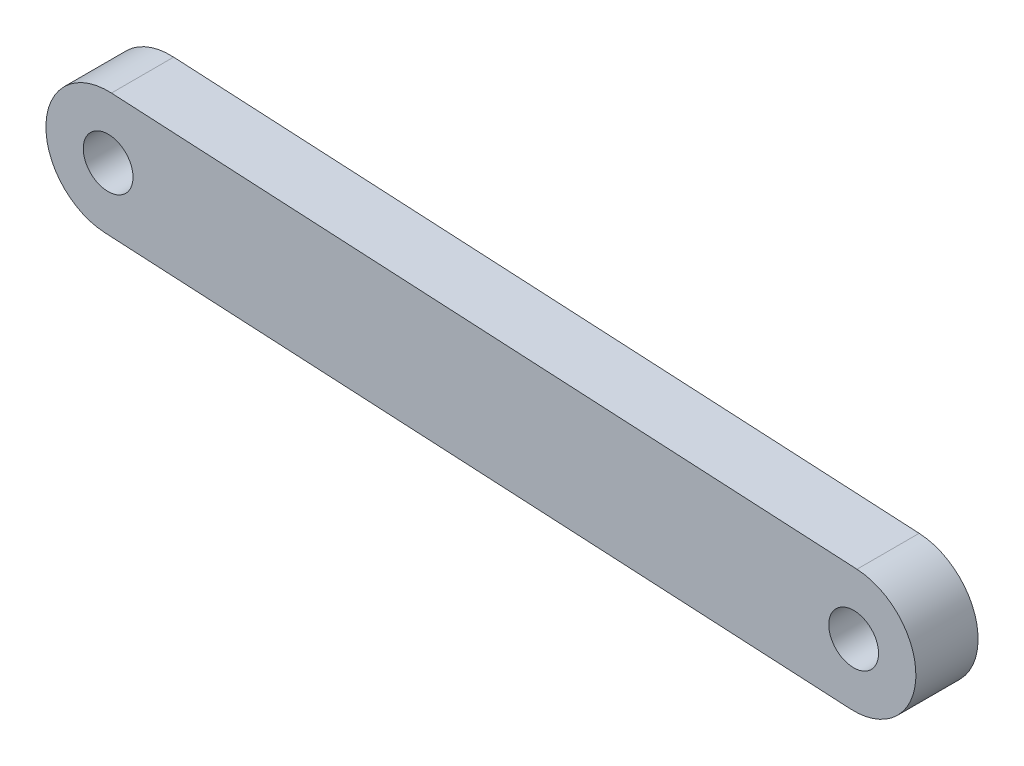
ISO-10303-21;
HEADER;
FILE_DESCRIPTION(('STEP AP214'),'2;1');
FILE_NAME('part.step','',(''),(''),'','','');
FILE_SCHEMA(('AUTOMOTIVE_DESIGN { 1 0 10303 214 1 1 1 1 }'));
ENDSEC;
DATA;
#1=APPLICATION_CONTEXT('core data for automotive mechanical design processes');
#2=APPLICATION_PROTOCOL_DEFINITION('international standard','automotive_design',2000,#1);
#3=PRODUCT_CONTEXT('',#1,'mechanical');
#4=PRODUCT('Part','Part','',(#3));
#5=PRODUCT_RELATED_PRODUCT_CATEGORY('part','',(#4));
#6=PRODUCT_DEFINITION_FORMATION('','',#4);
#7=PRODUCT_DEFINITION_CONTEXT('part definition',#1,'design');
#8=PRODUCT_DEFINITION('design','',#6,#7);
#9=PRODUCT_DEFINITION_SHAPE('','',#8);
#10=(LENGTH_UNIT() NAMED_UNIT(*) SI_UNIT(.MILLI.,.METRE.));
#11=(NAMED_UNIT(*) PLANE_ANGLE_UNIT() SI_UNIT($,.RADIAN.));
#12=(NAMED_UNIT(*) SI_UNIT($,.STERADIAN.) SOLID_ANGLE_UNIT());
#13=UNCERTAINTY_MEASURE_WITH_UNIT(LENGTH_MEASURE(1.E-05),#10,'distance_accuracy_value','');
#14=(GEOMETRIC_REPRESENTATION_CONTEXT(3) GLOBAL_UNCERTAINTY_ASSIGNED_CONTEXT((#13)) GLOBAL_UNIT_ASSIGNED_CONTEXT((#10,
#11,#12)) REPRESENTATION_CONTEXT('',''));
#15=CARTESIAN_POINT('',(0.,0.,0.));
#16=DIRECTION('',(0.,0.,1.));
#17=DIRECTION('',(1.,0.,0.));
#18=AXIS2_PLACEMENT_3D('',#15,#16,#17);
#19=CARTESIAN_POINT('',(-35.5373266073171,-8.81247047670461,5.));
#20=DIRECTION('',(0.,0.,1.));
#21=DIRECTION('',(0.,-1.,0.));
#22=AXIS2_PLACEMENT_3D('',#19,#20,#21);
#23=PLANE('',#22);
#24=CARTESIAN_POINT('',(-35.5373266073171,-8.81247047670461,5.));
#25=DIRECTION('',(0.,0.,1.));
#26=DIRECTION('',(0.,-1.,0.));
#27=AXIS2_PLACEMENT_3D('',#24,#25,#26);
#28=CIRCLE('',#27,2.);
#29=CARTESIAN_POINT('',(-35.5373266073171,-10.8124704767046,5.));
#30=VERTEX_POINT('',#29);
#31=EDGE_CURVE('E99',#30,#30,#28,.T.);
#32=ORIENTED_EDGE('',*,*,#31,.F.);
#33=EDGE_LOOP('',(#32));
#34=FACE_BOUND('',#33,.T.);
#35=CARTESIAN_POINT('',(-35.5373266073171,-8.81247047670461,5.));
#36=DIRECTION('',(0.,0.,1.));
#37=DIRECTION('',(0.,-1.,0.));
#38=AXIS2_PLACEMENT_3D('',#35,#36,#37);
#39=CIRCLE('',#38,5.);
#40=CARTESIAN_POINT('',(-35.802717202182,-13.8054222922299,5.));
#41=VERTEX_POINT('',#40);
#42=CARTESIAN_POINT('',(-35.2719360124522,-3.81951866117932,5.));
#43=VERTEX_POINT('',#42);
#44=EDGE_CURVE('E84',#41,#43,#39,.T.);
#45=ORIENTED_EDGE('',*,*,#44,.T.);
#46=DIRECTION('',(-0.998590363105057,0.0530781189729777,0.));
#47=VECTOR('',#46,1.);
#48=CARTESIAN_POINT('',(-35.2719360124522,-3.81951866117932,5.));
#49=LINE('',#48,#47);
#50=CARTESIAN_POINT('',(-95.1873577987556,-0.634831522800653,5.));
#51=VERTEX_POINT('',#50);
#52=EDGE_CURVE('E79',#43,#51,#49,.T.);
#53=ORIENTED_EDGE('',*,*,#52,.T.);
#54=CARTESIAN_POINT('',(-95.4527483936205,-5.62778333832594,5.));
#55=DIRECTION('',(0.,0.,1.));
#56=DIRECTION('',(0.,1.,0.));
#57=AXIS2_PLACEMENT_3D('',#54,#55,#56);
#58=CIRCLE('',#57,4.99999999999999);
#59=CARTESIAN_POINT('',(-95.7181389884854,-10.6207351538512,5.));
#60=VERTEX_POINT('',#59);
#61=EDGE_CURVE('E82',#51,#60,#58,.T.);
#62=ORIENTED_EDGE('',*,*,#61,.T.);
#63=DIRECTION('',(0.998590363105057,-0.053078118972978,0.));
#64=VECTOR('',#63,1.);
#65=CARTESIAN_POINT('',(-35.802717202182,-13.8054222922299,5.));
#66=LINE('',#65,#64);
#67=EDGE_CURVE('E49',#60,#41,#66,.T.);
#68=ORIENTED_EDGE('',*,*,#67,.T.);
#69=EDGE_LOOP('',(#45,#53,#62,#68));
#70=FACE_BOUND('',#69,.T.);
#71=CARTESIAN_POINT('',(-95.4527483936205,-5.62778333832594,5.));
#72=DIRECTION('',(0.,0.,1.));
#73=DIRECTION('',(0.,-1.,0.));
#74=AXIS2_PLACEMENT_3D('',#71,#72,#73);
#75=CIRCLE('',#74,2.);
#76=CARTESIAN_POINT('',(-95.4527483936205,-7.62778333832594,5.));
#77=VERTEX_POINT('',#76);
#78=EDGE_CURVE('E114',#77,#77,#75,.T.);
#79=ORIENTED_EDGE('',*,*,#78,.F.);
#80=EDGE_LOOP('',(#79));
#81=FACE_BOUND('',#80,.T.);
#82=ADVANCED_FACE('F32',(#34,#70,#81),#23,.T.);
#83=CARTESIAN_POINT('',(-35.5373266073171,-8.81247047670461,0.));
#84=DIRECTION('',(0.,0.,1.));
#85=DIRECTION('',(0.,-1.,0.));
#86=AXIS2_PLACEMENT_3D('',#83,#84,#85);
#87=PLANE('',#86);
#88=CARTESIAN_POINT('',(-35.5373266073171,-8.81247047670461,0.));
#89=DIRECTION('',(0.,0.,1.));
#90=DIRECTION('',(0.,-1.,0.));
#91=AXIS2_PLACEMENT_3D('',#88,#89,#90);
#92=CIRCLE('',#91,5.);
#93=CARTESIAN_POINT('',(-35.802717202182,-13.8054222922299,0.));
#94=VERTEX_POINT('',#93);
#95=CARTESIAN_POINT('',(-35.2719360124522,-3.81951866117932,0.));
#96=VERTEX_POINT('',#95);
#97=EDGE_CURVE('E96',#94,#96,#92,.T.);
#98=ORIENTED_EDGE('',*,*,#97,.F.);
#99=DIRECTION('',(0.998590363105057,-0.053078118972978,0.));
#100=VECTOR('',#99,1.);
#101=CARTESIAN_POINT('',(-35.802717202182,-13.8054222922299,0.));
#102=LINE('',#101,#100);
#103=CARTESIAN_POINT('',(-95.7181389884854,-10.6207351538512,0.));
#104=VERTEX_POINT('',#103);
#105=EDGE_CURVE('E72',#104,#94,#102,.T.);
#106=ORIENTED_EDGE('',*,*,#105,.F.);
#107=CARTESIAN_POINT('',(-95.4527483936205,-5.62778333832593,0.));
#108=DIRECTION('',(0.,0.,1.));
#109=DIRECTION('',(0.,1.,0.));
#110=AXIS2_PLACEMENT_3D('',#107,#108,#109);
#111=CIRCLE('',#110,4.99999999999999);
#112=CARTESIAN_POINT('',(-95.1873577987556,-0.634831522800652,0.));
#113=VERTEX_POINT('',#112);
#114=EDGE_CURVE('E66',#113,#104,#111,.T.);
#115=ORIENTED_EDGE('',*,*,#114,.F.);
#116=DIRECTION('',(-0.998590363105057,0.0530781189729777,0.));
#117=VECTOR('',#116,1.);
#118=CARTESIAN_POINT('',(-35.2719360124522,-3.81951866117932,0.));
#119=LINE('',#118,#117);
#120=EDGE_CURVE('E88',#96,#113,#119,.T.);
#121=ORIENTED_EDGE('',*,*,#120,.F.);
#122=EDGE_LOOP('',(#98,#106,#115,#121));
#123=FACE_BOUND('',#122,.T.);
#124=CARTESIAN_POINT('',(-35.5373266073171,-8.81247047670461,0.));
#125=DIRECTION('',(0.,0.,1.));
#126=DIRECTION('',(0.,-1.,0.));
#127=AXIS2_PLACEMENT_3D('',#124,#125,#126);
#128=CIRCLE('',#127,2.);
#129=CARTESIAN_POINT('',(-35.5373266073171,-10.8124704767046,0.));
#130=VERTEX_POINT('',#129);
#131=EDGE_CURVE('E111',#130,#130,#128,.T.);
#132=ORIENTED_EDGE('',*,*,#131,.T.);
#133=EDGE_LOOP('',(#132));
#134=FACE_BOUND('',#133,.T.);
#135=CARTESIAN_POINT('',(-95.4527483936205,-5.62778333832593,0.));
#136=DIRECTION('',(0.,0.,1.));
#137=DIRECTION('',(0.,-1.,0.));
#138=AXIS2_PLACEMENT_3D('',#135,#136,#137);
#139=CIRCLE('',#138,2.);
#140=CARTESIAN_POINT('',(-95.4527483936205,-7.62778333832594,0.));
#141=VERTEX_POINT('',#140);
#142=EDGE_CURVE('E117',#141,#141,#139,.T.);
#143=ORIENTED_EDGE('',*,*,#142,.T.);
#144=EDGE_LOOP('',(#143));
#145=FACE_BOUND('',#144,.T.);
#146=ADVANCED_FACE('F107',(#123,#134,#145),#87,.F.);
#147=CARTESIAN_POINT('',(-35.5373266073171,-8.81247047670461,5.));
#148=DIRECTION('',(0.,0.,-1.));
#149=DIRECTION('',(0.,1.,0.));
#150=AXIS2_PLACEMENT_3D('',#147,#148,#149);
#151=CYLINDRICAL_SURFACE('',#150,5.);
#152=ORIENTED_EDGE('',*,*,#97,.T.);
#153=DIRECTION('',(0.,0.,-1.));
#154=VECTOR('',#153,1.);
#155=CARTESIAN_POINT('',(-35.2719360124522,-3.81951866117932,5.));
#156=LINE('',#155,#154);
#157=EDGE_CURVE('E11',#43,#96,#156,.T.);
#158=ORIENTED_EDGE('',*,*,#157,.F.);
#159=ORIENTED_EDGE('',*,*,#44,.F.);
#160=DIRECTION('',(0.,0.,-1.));
#161=VECTOR('',#160,1.);
#162=CARTESIAN_POINT('',(-35.802717202182,-13.8054222922299,5.));
#163=LINE('',#162,#161);
#164=EDGE_CURVE('E92',#41,#94,#163,.T.);
#165=ORIENTED_EDGE('',*,*,#164,.T.);
#166=EDGE_LOOP('',(#152,#158,#159,#165));
#167=FACE_BOUND('',#166,.T.);
#168=ADVANCED_FACE('F34',(#167),#151,.T.);
#169=CARTESIAN_POINT('',(-35.2719360124522,-3.81951866117932,5.));
#170=DIRECTION('',(-0.0530781189729777,-0.998590363105058,0.));
#171=DIRECTION('',(0.998590363105058,-0.0530781189729777,0.));
#172=AXIS2_PLACEMENT_3D('',#169,#170,#171);
#173=PLANE('',#172);
#174=ORIENTED_EDGE('',*,*,#120,.T.);
#175=DIRECTION('',(0.,0.,-1.));
#176=VECTOR('',#175,1.);
#177=CARTESIAN_POINT('',(-95.1873577987556,-0.634831522800653,5.));
#178=LINE('',#177,#176);
#179=EDGE_CURVE('E41',#51,#113,#178,.T.);
#180=ORIENTED_EDGE('',*,*,#179,.F.);
#181=ORIENTED_EDGE('',*,*,#52,.F.);
#182=ORIENTED_EDGE('',*,*,#157,.T.);
#183=EDGE_LOOP('',(#174,#180,#181,#182));
#184=FACE_BOUND('',#183,.T.);
#185=ADVANCED_FACE('F87',(#184),#173,.F.);
#186=CARTESIAN_POINT('',(-95.4527483936205,-5.62778333832594,5.));
#187=DIRECTION('',(0.,0.,-1.));
#188=DIRECTION('',(0.,1.,0.));
#189=AXIS2_PLACEMENT_3D('',#186,#187,#188);
#190=CYLINDRICAL_SURFACE('',#189,4.99999999999999);
#191=ORIENTED_EDGE('',*,*,#114,.T.);
#192=DIRECTION('',(0.,0.,-1.));
#193=VECTOR('',#192,1.);
#194=CARTESIAN_POINT('',(-95.7181389884854,-10.6207351538512,5.));
#195=LINE('',#194,#193);
#196=EDGE_CURVE('E89',#60,#104,#195,.T.);
#197=ORIENTED_EDGE('',*,*,#196,.F.);
#198=ORIENTED_EDGE('',*,*,#61,.F.);
#199=ORIENTED_EDGE('',*,*,#179,.T.);
#200=EDGE_LOOP('',(#191,#197,#198,#199));
#201=FACE_BOUND('',#200,.T.);
#202=ADVANCED_FACE('F90',(#201),#190,.T.);
#203=CARTESIAN_POINT('',(-35.802717202182,-13.8054222922299,5.));
#204=DIRECTION('',(0.053078118972978,0.998590363105057,0.));
#205=DIRECTION('',(-0.998590363105058,0.053078118972978,0.));
#206=AXIS2_PLACEMENT_3D('',#203,#204,#205);
#207=PLANE('',#206);
#208=ORIENTED_EDGE('',*,*,#105,.T.);
#209=ORIENTED_EDGE('',*,*,#164,.F.);
#210=ORIENTED_EDGE('',*,*,#67,.F.);
#211=ORIENTED_EDGE('',*,*,#196,.T.);
#212=EDGE_LOOP('',(#208,#209,#210,#211));
#213=FACE_BOUND('',#212,.T.);
#214=ADVANCED_FACE('F104',(#213),#207,.F.);
#215=CARTESIAN_POINT('',(-35.5373266073171,-8.81247047670461,5.));
#216=DIRECTION('',(0.,0.,-1.));
#217=DIRECTION('',(0.,1.,0.));
#218=AXIS2_PLACEMENT_3D('',#215,#216,#217);
#219=CYLINDRICAL_SURFACE('',#218,2.);
#220=ORIENTED_EDGE('',*,*,#31,.T.);
#221=EDGE_LOOP('',(#220));
#222=FACE_BOUND('',#221,.T.);
#223=ORIENTED_EDGE('',*,*,#131,.F.);
#224=EDGE_LOOP('',(#223));
#225=FACE_BOUND('',#224,.T.);
#226=ADVANCED_FACE('F134',(#222,#225),#219,.F.);
#227=CARTESIAN_POINT('',(-95.4527483936205,-5.62778333832594,5.));
#228=DIRECTION('',(0.,0.,-1.));
#229=DIRECTION('',(0.,1.,0.));
#230=AXIS2_PLACEMENT_3D('',#227,#228,#229);
#231=CYLINDRICAL_SURFACE('',#230,2.);
#232=ORIENTED_EDGE('',*,*,#78,.T.);
#233=EDGE_LOOP('',(#232));
#234=FACE_BOUND('',#233,.T.);
#235=ORIENTED_EDGE('',*,*,#142,.F.);
#236=EDGE_LOOP('',(#235));
#237=FACE_BOUND('',#236,.T.);
#238=ADVANCED_FACE('F123',(#234,#237),#231,.F.);
#239=CLOSED_SHELL('',(#82,#146,#168,#185,#202,#214,#226,#238));
#240=MANIFOLD_SOLID_BREP('B2',#239);
#241=ADVANCED_BREP_SHAPE_REPRESENTATION('',(#18,#240),#14);
#242=SHAPE_DEFINITION_REPRESENTATION(#9,#241);
ENDSEC;
END-ISO-10303-21;
